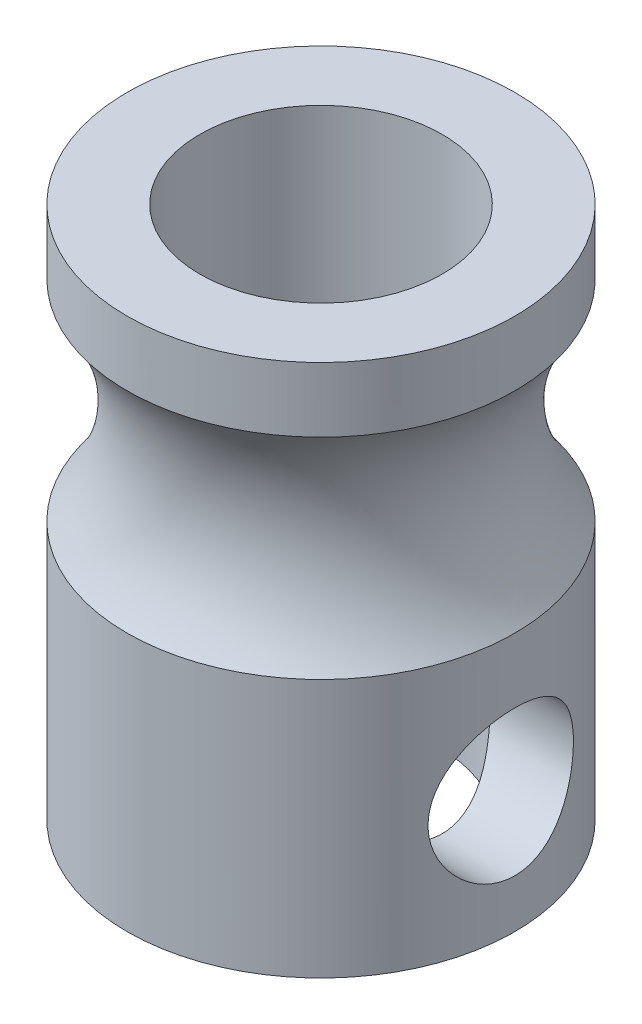
ISO-10303-21;
HEADER;
FILE_DESCRIPTION(('STEP AP214'),'2;1');
FILE_NAME('part.step','',(''),(''),'','','');
FILE_SCHEMA(('AUTOMOTIVE_DESIGN { 1 0 10303 214 1 1 1 1 }'));
ENDSEC;
DATA;
#1=APPLICATION_CONTEXT('core data for automotive mechanical design processes');
#2=APPLICATION_PROTOCOL_DEFINITION('international standard','automotive_design',2000,#1);
#3=PRODUCT_CONTEXT('',#1,'mechanical');
#4=PRODUCT('Part','Part','',(#3));
#5=PRODUCT_RELATED_PRODUCT_CATEGORY('part','',(#4));
#6=PRODUCT_DEFINITION_FORMATION('','',#4);
#7=PRODUCT_DEFINITION_CONTEXT('part definition',#1,'design');
#8=PRODUCT_DEFINITION('design','',#6,#7);
#9=PRODUCT_DEFINITION_SHAPE('','',#8);
#10=(LENGTH_UNIT() NAMED_UNIT(*) SI_UNIT(.MILLI.,.METRE.));
#11=(NAMED_UNIT(*) PLANE_ANGLE_UNIT() SI_UNIT($,.RADIAN.));
#12=(NAMED_UNIT(*) SI_UNIT($,.STERADIAN.) SOLID_ANGLE_UNIT());
#13=UNCERTAINTY_MEASURE_WITH_UNIT(LENGTH_MEASURE(1.E-05),#10,'distance_accuracy_value','');
#14=(GEOMETRIC_REPRESENTATION_CONTEXT(3) GLOBAL_UNCERTAINTY_ASSIGNED_CONTEXT((#13)) GLOBAL_UNIT_ASSIGNED_CONTEXT((#10,
#11,#12)) REPRESENTATION_CONTEXT('',''));
#15=CARTESIAN_POINT('',(0.,0.,0.));
#16=DIRECTION('',(0.,0.,1.));
#17=DIRECTION('',(1.,0.,0.));
#18=AXIS2_PLACEMENT_3D('',#15,#16,#17);
#19=CARTESIAN_POINT('',(0.,11.,0.));
#20=DIRECTION('',(0.,-1.,0.));
#21=DIRECTION('',(0.,0.,-1.));
#22=AXIS2_PLACEMENT_3D('',#19,#20,#21);
#23=CYLINDRICAL_SURFACE('',#22,4.);
#24=CARTESIAN_POINT('',(0.,5.3349364905389,0.));
#25=DIRECTION('',(0.,1.,0.));
#26=DIRECTION('',(0.,0.,1.));
#27=AXIS2_PLACEMENT_3D('',#24,#25,#26);
#28=CIRCLE('',#27,4.);
#29=CARTESIAN_POINT('',(0.,5.3349364905389,4.));
#30=VERTEX_POINT('',#29);
#31=EDGE_CURVE('E36',#30,#30,#28,.F.);
#32=ORIENTED_EDGE('',*,*,#31,.T.);
#33=EDGE_LOOP('',(#32));
#34=FACE_BOUND('',#33,.T.);
#35=CARTESIAN_POINT('',(0.,0.,0.));
#36=DIRECTION('',(0.,1.,0.));
#37=DIRECTION('',(0.,0.,1.));
#38=AXIS2_PLACEMENT_3D('',#35,#36,#37);
#39=CIRCLE('',#38,4.);
#40=CARTESIAN_POINT('',(0.,0.,4.));
#41=VERTEX_POINT('',#40);
#42=EDGE_CURVE('E45',#41,#41,#39,.T.);
#43=ORIENTED_EDGE('',*,*,#42,.T.);
#44=EDGE_LOOP('',(#43));
#45=FACE_BOUND('',#44,.T.);
#46=CARTESIAN_POINT('',(3.70809924354783,2.5,-1.5));
#47=CARTESIAN_POINT('',(3.70809640633806,2.41899251627921,-1.50000304106109));
#48=CARTESIAN_POINT('',(3.71078260240986,2.33800507749636,-1.49341597549487));
#49=CARTESIAN_POINT('',(3.72116159304967,2.1784719170868,-1.46736187895468));
#50=CARTESIAN_POINT('',(3.72885423767112,2.09992612240499,-1.44789523373263));
#51=CARTESIAN_POINT('',(3.748254802809,1.94762462838647,-1.39689657610574));
#52=CARTESIAN_POINT('',(3.7599530956926,1.87385794334892,-1.36539347266348));
#53=CARTESIAN_POINT('',(3.78603134206598,1.73262810318116,-1.29131856742698));
#54=CARTESIAN_POINT('',(3.80041210067323,1.66516684971748,-1.24874344095039));
#55=CARTESIAN_POINT('',(3.83103574665713,1.53510968837718,-1.15146661374162));
#56=CARTESIAN_POINT('',(3.84733341923603,1.47287147037061,-1.09630381213306));
#57=CARTESIAN_POINT('',(3.87949750628547,1.35827718532851,-0.976395839778926));
#58=CARTESIAN_POINT('',(3.89536382814785,1.30592322625815,-0.911648630256679));
#59=CARTESIAN_POINT('',(3.92552873936553,1.21086048770439,-0.771694655177599));
#60=CARTESIAN_POINT('',(3.93975561223505,1.16854052528414,-0.696206947538027));
#61=CARTESIAN_POINT('',(3.96438007973848,1.09734882747509,-0.538555771965247));
#62=CARTESIAN_POINT('',(3.97477900217006,1.06847242800803,-0.456394630933535));
#63=CARTESIAN_POINT('',(3.9901869710344,1.02624210422538,-0.291489341676831));
#64=CARTESIAN_POINT('',(3.99540915214774,1.01227237255954,-0.208923197281596));
#65=CARTESIAN_POINT('',(4.0006401410794,0.998278799055012,-0.0424643637947855));
#66=CARTESIAN_POINT('',(4.00065064414902,0.998250422381291,0.0414278850628334));
#67=CARTESIAN_POINT('',(3.99559265903894,1.01178176146517,0.203743543064476));
#68=CARTESIAN_POINT('',(3.99077541996683,1.02466929794882,0.2822321782669));
#69=CARTESIAN_POINT('',(3.97693274932263,1.06253591522555,0.435839217984391));
#70=CARTESIAN_POINT('',(3.96790701975577,1.08751585226204,0.510957383430298));
#71=CARTESIAN_POINT('',(3.94637769167531,1.14917045167585,0.656989017303104));
#72=CARTESIAN_POINT('',(3.93382539470077,1.18601000526841,0.72782539228731));
#73=CARTESIAN_POINT('',(3.90651310225279,1.27019209692939,0.86248660795756));
#74=CARTESIAN_POINT('',(3.8917523951284,1.3175380230176,0.926309176932323));
#75=CARTESIAN_POINT('',(3.86052529655816,1.42462728628319,1.04909048680094));
#76=CARTESIAN_POINT('',(3.84400963763883,1.48493391565043,1.10754614526348));
#77=CARTESIAN_POINT('',(3.81182460645722,1.61459299332156,1.21370395569342));
#78=CARTESIAN_POINT('',(3.79615544748847,1.68394770658664,1.261403406929));
#79=CARTESIAN_POINT('',(3.76712703500335,1.83171946746282,1.34565611808152));
#80=CARTESIAN_POINT('',(3.75382677150277,1.91030349368607,1.38193847851831));
#81=CARTESIAN_POINT('',(3.73172438629002,2.07309622516757,1.44056464441501));
#82=CARTESIAN_POINT('',(3.72291976205783,2.15730177159369,1.46291620605595));
#83=CARTESIAN_POINT('',(3.71139597222848,2.32397596231595,1.49190191709668));
#84=CARTESIAN_POINT('',(3.70836785241537,2.40628410553614,1.49933521158966));
#85=CARTESIAN_POINT('',(3.70786539525016,2.57100935674174,1.50057885636272));
#86=CARTESIAN_POINT('',(3.71038967003987,2.65342643235247,1.49439261093762));
#87=CARTESIAN_POINT('',(3.72039381629735,2.81192992228768,1.46929733520157));
#88=CARTESIAN_POINT('',(3.72763276216449,2.88813113576466,1.45100618334225));
#89=CARTESIAN_POINT('',(3.74596487046361,3.03634794472019,1.40299774640638));
#90=CARTESIAN_POINT('',(3.75705882250173,3.10836267916813,1.37327812034623));
#91=CARTESIAN_POINT('',(3.7823624311608,3.24916443807621,1.30200292275278));
#92=CARTESIAN_POINT('',(3.79667328892065,3.31772929213734,1.26004545177047));
#93=CARTESIAN_POINT('',(3.82662814294291,3.44712898172604,1.16591317862479));
#94=CARTESIAN_POINT('',(3.84227262594077,3.50796097462463,1.11373463696435));
#95=CARTESIAN_POINT('',(3.87433046553184,3.6241683731951,0.996727340900938));
#96=CARTESIAN_POINT('',(3.89072969357028,3.67895340876875,0.931306341491061));
#97=CARTESIAN_POINT('',(3.92149874963302,3.77683836758944,0.79179747175315));
#98=CARTESIAN_POINT('',(3.93586857107664,3.81993825294584,0.717709573322673));
#99=CARTESIAN_POINT('',(3.96094985704552,3.89294605619961,0.563016329468477));
#100=CARTESIAN_POINT('',(3.9716738133801,3.9228991237926,0.482434433064627));
#101=CARTESIAN_POINT('',(3.98829436712571,3.96865641384992,0.316881887523255));
#102=CARTESIAN_POINT('',(3.99419323299412,3.9844672854224,0.231913320723593));
#103=CARTESIAN_POINT('',(4.00028407317073,4.00077440275483,0.0653355852738156));
#104=CARTESIAN_POINT('',(4.00078860953764,4.00210948305899,-0.0161807680608453));
#105=CARTESIAN_POINT('',(3.99684889809223,3.99158484055461,-0.178226786412424));
#106=CARTESIAN_POINT('',(3.9924052471313,3.97972670911414,-0.258756569245257));
#107=CARTESIAN_POINT('',(3.97921089603771,3.94374114850638,-0.414548248377126));
#108=CARTESIAN_POINT('',(3.97056791378017,3.91992009412164,-0.489890731068834));
#109=CARTESIAN_POINT('',(3.9498778362099,3.86098998661564,-0.63551547300639));
#110=CARTESIAN_POINT('',(3.93783009655664,3.82587879669525,-0.705796771275542));
#111=CARTESIAN_POINT('',(3.91090618300074,3.74368605649519,-0.842540176994412));
#112=CARTESIAN_POINT('',(3.89593240108828,3.69616335948585,-0.908717548846849));
#113=CARTESIAN_POINT('',(3.86499507694844,3.59119216981239,-1.03241734752336));
#114=CARTESIAN_POINT('',(3.84903118274027,3.53374013419212,-1.0899366712559));
#115=CARTESIAN_POINT('',(3.81688129739175,3.40693586835494,-1.19781214236196));
#116=CARTESIAN_POINT('',(3.8007280534916,3.33711559784569,-1.24762999816025));
#117=CARTESIAN_POINT('',(3.77098325003638,3.18958413042667,-1.33484709556843));
#118=CARTESIAN_POINT('',(3.75739195631216,3.11187211594652,-1.37224504878157));
#119=CARTESIAN_POINT('',(3.73402269853266,2.94704431902459,-1.4346588697426));
#120=CARTESIAN_POINT('',(3.7244380329086,2.85966563348821,-1.45906002899523));
#121=CARTESIAN_POINT('',(3.71147994336315,2.68151472804421,-1.49172356722079));
#122=CARTESIAN_POINT('',(3.70810242179736,2.59074478729001,-1.4999965933957));
#123=CARTESIAN_POINT('',(3.70809924354783,2.5,-1.5));
#124=B_SPLINE_CURVE_WITH_KNOTS('',3,(#46,#47,#48,#49,#50,#51,#52,#53,#54,#55,#56,#57,#58,#59,
#60,#61,#62,#63,#64,#65,#66,#67,#68,#69,#70,#71,#72,#73,#74,#75,#76,#77,#78,#79,#80,#81,#82,#83,
#84,#85,#86,#87,#88,#89,#90,#91,#92,#93,#94,#95,#96,#97,#98,#99,#100,#101,#102,#103,#104,#105,
#106,#107,#108,#109,#110,#111,#112,#113,#114,#115,#116,#117,#118,#119,#120,#121,#122,#123),
.UNSPECIFIED.,.T.,.F.,(4,2,2,2,2,2,2,2,2,2,2,2,2,2,2,2,2,2,2,2,2,2,2,2,2,2,2,2,2,2,2,2,2,2,2,2,
2,2,4),(0.,0.24268454141617,0.485361814598854,0.72745985675703,0.969630679682933,
1.22274652401128,1.47591628822983,1.73770072136421,1.9993942638133,2.24980018489679,
2.50012465404857,2.73806472803194,2.97602165263335,3.21744131210668,3.45893893628976,
3.71456675065874,3.97025867827335,4.23162592252966,4.49284751635474,4.73965657740485,
4.98640395388884,5.22143845928198,5.45652113429526,5.70041561005821,5.94439948466355,
6.20385016993624,6.46330169650178,6.72185508890168,6.98028685560127,7.22365720549936,
7.4669982031948,7.7044027400389,7.94185223512831,8.18928323676987,8.43680270894964,
8.69738599542079,8.95799630544242,9.23003178870926,9.50188762323053),.UNSPECIFIED.);
#125=CARTESIAN_POINT('',(3.70809924354783,2.5,-1.5));
#126=VERTEX_POINT('',#125);
#127=EDGE_CURVE('E63',#126,#126,#124,.T.);
#128=ORIENTED_EDGE('',*,*,#127,.T.);
#129=EDGE_LOOP('',(#128));
#130=FACE_BOUND('',#129,.T.);
#131=ADVANCED_FACE('F31',(#34,#45,#130),#23,.T.);
#132=CARTESIAN_POINT('',(0.,11.,0.));
#133=DIRECTION('',(0.,1.,0.));
#134=DIRECTION('',(0.,0.,1.));
#135=AXIS2_PLACEMENT_3D('',#132,#133,#134);
#136=PLANE('',#135);
#137=CARTESIAN_POINT('',(0.,11.,0.));
#138=DIRECTION('',(0.,1.,0.));
#139=DIRECTION('',(0.,0.,1.));
#140=AXIS2_PLACEMENT_3D('',#137,#138,#139);
#141=CIRCLE('',#140,4.);
#142=CARTESIAN_POINT('',(0.,11.,4.));
#143=VERTEX_POINT('',#142);
#144=EDGE_CURVE('E40',#143,#143,#141,.T.);
#145=ORIENTED_EDGE('',*,*,#144,.T.);
#146=EDGE_LOOP('',(#145));
#147=FACE_BOUND('',#146,.T.);
#148=CARTESIAN_POINT('',(0.,11.,0.));
#149=DIRECTION('',(0.,1.,0.));
#150=DIRECTION('',(0.,0.,1.));
#151=AXIS2_PLACEMENT_3D('',#148,#149,#150);
#152=CIRCLE('',#151,2.5);
#153=CARTESIAN_POINT('',(0.,11.,2.5));
#154=VERTEX_POINT('',#153);
#155=EDGE_CURVE('E69',#154,#154,#152,.T.);
#156=ORIENTED_EDGE('',*,*,#155,.F.);
#157=EDGE_LOOP('',(#156));
#158=FACE_BOUND('',#157,.T.);
#159=ADVANCED_FACE('F85',(#147,#158),#136,.T.);
#160=CARTESIAN_POINT('',(0.,0.,0.));
#161=DIRECTION('',(0.,1.,0.));
#162=DIRECTION('',(0.,0.,1.));
#163=AXIS2_PLACEMENT_3D('',#160,#161,#162);
#164=PLANE('',#163);
#165=ORIENTED_EDGE('',*,*,#42,.F.);
#166=EDGE_LOOP('',(#165));
#167=FACE_BOUND('',#166,.T.);
#168=CARTESIAN_POINT('',(0.,0.,0.));
#169=DIRECTION('',(0.,1.,0.));
#170=DIRECTION('',(0.,0.,1.));
#171=AXIS2_PLACEMENT_3D('',#168,#169,#170);
#172=CIRCLE('',#171,2.5);
#173=CARTESIAN_POINT('',(0.,0.,2.5));
#174=VERTEX_POINT('',#173);
#175=EDGE_CURVE('E68',#174,#174,#172,.T.);
#176=ORIENTED_EDGE('',*,*,#175,.T.);
#177=EDGE_LOOP('',(#176));
#178=FACE_BOUND('',#177,.T.);
#179=ADVANCED_FACE('F75',(#167,#178),#164,.F.);
#180=CARTESIAN_POINT('',(0.,9.6650635094611,0.));
#181=DIRECTION('',(0.,-1.,0.));
#182=DIRECTION('',(0.,0.,-1.));
#183=AXIS2_PLACEMENT_3D('',#180,#181,#182);
#184=CIRCLE('',#183,4.);
#185=CARTESIAN_POINT('',(0.,9.6650635094611,-4.));
#186=VERTEX_POINT('',#185);
#187=EDGE_CURVE('E52',#186,#186,#184,.F.);
#188=ORIENTED_EDGE('',*,*,#187,.T.);
#189=EDGE_LOOP('',(#188));
#190=FACE_BOUND('',#189,.T.);
#191=ORIENTED_EDGE('',*,*,#144,.F.);
#192=EDGE_LOOP('',(#191));
#193=FACE_BOUND('',#192,.T.);
#194=ADVANCED_FACE('F33',(#190,#193),#23,.T.);
#195=CARTESIAN_POINT('',(0.,11.,0.));
#196=DIRECTION('',(0.,-1.,0.));
#197=DIRECTION('',(0.,0.,-1.));
#198=AXIS2_PLACEMENT_3D('',#195,#196,#197);
#199=CYLINDRICAL_SURFACE('',#198,2.5);
#200=CARTESIAN_POINT('',(2.,2.5,-1.5));
#201=CARTESIAN_POINT('',(1.99999416642511,2.42452102471036,-1.50000404108592));
#202=CARTESIAN_POINT('',(2.00433633903481,2.3490615659202,-1.49426852824013));
#203=CARTESIAN_POINT('',(2.02092590613883,2.20067609603778,-1.47174965152787));
#204=CARTESIAN_POINT('',(2.03318155043097,2.1277528126149,-1.45495475788936));
#205=CARTESIAN_POINT('',(2.0636233903473,1.98691635832272,-1.41143486335795));
#206=CARTESIAN_POINT('',(2.0817666618312,1.91897116196473,-1.3847815450315));
#207=CARTESIAN_POINT('',(2.12185904995836,1.78856254663208,-1.32252909283019));
#208=CARTESIAN_POINT('',(2.14380930122416,1.72610077030486,-1.28692729054693));
#209=CARTESIAN_POINT('',(2.19228594587542,1.60005098333592,-1.20271292747644));
#210=CARTESIAN_POINT('',(2.21904371037662,1.53725904287606,-1.15304179435289));
#211=CARTESIAN_POINT('',(2.27226229431061,1.42023523725825,-1.04426801309985));
#212=CARTESIAN_POINT('',(2.29872287517103,1.3660098483292,-0.985158296729612));
#213=CARTESIAN_POINT('',(2.35175567858734,1.2618661902903,-0.851442367411701));
#214=CARTESIAN_POINT('',(2.37803133577818,1.21304553633025,-0.775851995162547));
#215=CARTESIAN_POINT('',(2.42443786983179,1.12919027755557,-0.615654228271658));
#216=CARTESIAN_POINT('',(2.44457437988735,1.09414302587729,-0.53105519662633));
#217=CARTESIAN_POINT('',(2.4747098780044,1.04240407718735,-0.363771406742666));
#218=CARTESIAN_POINT('',(2.4854930393917,1.0242796390327,-0.281674698130914));
#219=CARTESIAN_POINT('',(2.49874939277545,1.00205719713688,-0.114970509382707));
#220=CARTESIAN_POINT('',(2.50123038813308,0.997946021999946,-0.0303654624001524));
#221=CARTESIAN_POINT('',(2.49783372711539,1.00361374734246,0.127637283737311));
#222=CARTESIAN_POINT('',(2.49295437513726,1.01173352616931,0.201123832865635));
#223=CARTESIAN_POINT('',(2.47707997553857,1.03847979564811,0.345464269151769));
#224=CARTESIAN_POINT('',(2.46608447529309,1.05710706390716,0.416317961051202));
#225=CARTESIAN_POINT('',(2.43884907201719,1.10416556270378,0.55405678046908));
#226=CARTESIAN_POINT('',(2.42257910450824,1.132653061139,0.620916491037618));
#227=CARTESIAN_POINT('',(2.38609637638748,1.19838461622554,0.748988660115612));
#228=CARTESIAN_POINT('',(2.36588259201812,1.23563094705901,0.810199646208012));
#229=CARTESIAN_POINT('',(2.32037925976362,1.32283909280445,0.9330742671432));
#230=CARTESIAN_POINT('',(2.2947718295215,1.37378831173574,0.993918663198194));
#231=CARTESIAN_POINT('',(2.24255554245601,1.48440411786018,1.10671465909275));
#232=CARTESIAN_POINT('',(2.21594536703375,1.54408250347451,1.1586540130834));
#233=CARTESIAN_POINT('',(2.16111075123946,1.67865340616355,1.25824837767417));
#234=CARTESIAN_POINT('',(2.13305661385124,1.75450757653946,1.30470933188632));
#235=CARTESIAN_POINT('',(2.08250879557267,1.91470623163661,1.38397217194232));
#236=CARTESIAN_POINT('',(2.0600049029882,1.99903471612564,1.41679921962189));
#237=CARTESIAN_POINT('',(2.02895865196731,2.15239363189535,1.46077497064843));
#238=CARTESIAN_POINT('',(2.01833888618316,2.22004063229664,1.47527903312665));
#239=CARTESIAN_POINT('',(2.00392150777558,2.35737361029948,1.49480872755284));
#240=CARTESIAN_POINT('',(2.00011596115116,2.42705712048456,1.49984538302907));
#241=CARTESIAN_POINT('',(1.99988914321323,2.56655168243571,1.50014781114183));
#242=CARTESIAN_POINT('',(2.00347810223984,2.63636277721521,1.49540004697659));
#243=CARTESIAN_POINT('',(2.01751520788652,2.77398734374856,1.47640290574941));
#244=CARTESIAN_POINT('',(2.02796877613213,2.84179919224025,1.46214601830139));
#245=CARTESIAN_POINT('',(2.054317683331,2.97371457947979,1.42488312618657));
#246=CARTESIAN_POINT('',(2.07020622092812,3.03782263653223,1.40188805257362));
#247=CARTESIAN_POINT('',(2.10571539417587,3.16147771573018,1.34796261057072));
#248=CARTESIAN_POINT('',(2.12533743689999,3.221023006366,1.31702924888212));
#249=CARTESIAN_POINT('',(2.17036819177737,3.34524008251225,1.24167439558512));
#250=CARTESIAN_POINT('',(2.19618239397369,3.40890083509657,1.19582663060303));
#251=CARTESIAN_POINT('',(2.2482175480362,3.52828548484946,1.09487395518701));
#252=CARTESIAN_POINT('',(2.27443886711455,3.58400169216912,1.03976018672402));
#253=CARTESIAN_POINT('',(2.32835625910913,3.69322400735043,0.913274837212766));
#254=CARTESIAN_POINT('',(2.3558007587587,3.74550072660584,0.840721108780191));
#255=CARTESIAN_POINT('',(2.40537639133459,3.83690277683665,0.68610310086802));
#256=CARTESIAN_POINT('',(2.42751104449411,3.87603682784092,0.604045176134702));
#257=CARTESIAN_POINT('',(2.46252280092775,3.93686820343137,0.438840232972138));
#258=CARTESIAN_POINT('',(2.47595588067329,3.95962622779111,0.356205963651258));
#259=CARTESIAN_POINT('',(2.494407389061,3.99071460284626,0.187383063890857));
#260=CARTESIAN_POINT('',(2.49943534582737,3.99906129071762,0.101198571781969));
#261=CARTESIAN_POINT('',(2.50040600461976,4.00067460858593,-0.0598120232009837));
#262=CARTESIAN_POINT('',(2.49747057186327,3.99580333456303,-0.134620583589706));
#263=CARTESIAN_POINT('',(2.48512948412095,3.97510617561839,-0.282148755978774));
#264=CARTESIAN_POINT('',(2.47572375706639,3.9592801686784,-0.354868344701914));
#265=CARTESIAN_POINT('',(2.45149427526962,3.91778042841621,-0.495145481978797));
#266=CARTESIAN_POINT('',(2.43675966858906,3.89226840387076,-0.56276703260883));
#267=CARTESIAN_POINT('',(2.40303337447155,3.83235940544525,-0.692781971999984));
#268=CARTESIAN_POINT('',(2.38404073252268,3.7979604391404,-0.755174184199832));
#269=CARTESIAN_POINT('',(2.34093432659381,3.71707480343124,-0.880263645295947));
#270=CARTESIAN_POINT('',(2.31648844639149,3.66968129098313,-0.94225869043994));
#271=CARTESIAN_POINT('',(2.26601907350661,3.56624696628228,-1.05789751536307));
#272=CARTESIAN_POINT('',(2.23999385274509,3.51019657439209,-1.11153190956916));
#273=CARTESIAN_POINT('',(2.18528165666204,3.3827144378223,-1.2159097535057));
#274=CARTESIAN_POINT('',(2.15667566270901,3.3102335138345,-1.26542406663367));
#275=CARTESIAN_POINT('',(2.10376464485145,3.15651514723346,-1.35156817210325));
#276=CARTESIAN_POINT('',(2.07945738811052,3.07528228601859,-1.38820466322661));
#277=CARTESIAN_POINT('',(2.0408000304796,2.9129357148628,-1.44437116535132));
#278=CARTESIAN_POINT('',(2.02577665830138,2.83240476403875,-1.46509526060187));
#279=CARTESIAN_POINT('',(2.00539032320036,2.66790260529632,-1.49289268240426));
#280=CARTESIAN_POINT('',(2.00000648744643,2.58393923424129,-1.49999550595837));
#281=CARTESIAN_POINT('',(2.,2.5,-1.5));
#282=B_SPLINE_CURVE_WITH_KNOTS('',3,(#200,#201,#202,#203,#204,#205,#206,#207,#208,#209,#210,
#211,#212,#213,#214,#215,#216,#217,#218,#219,#220,#221,#222,#223,#224,#225,#226,#227,#228,#229,
#230,#231,#232,#233,#234,#235,#236,#237,#238,#239,#240,#241,#242,#243,#244,#245,#246,#247,#248,
#249,#250,#251,#252,#253,#254,#255,#256,#257,#258,#259,#260,#261,#262,#263,#264,#265,#266,#267,
#268,#269,#270,#271,#272,#273,#274,#275,#276,#277,#278,#279,#280,#281),.UNSPECIFIED.,.T.,.F.,(4,
2,2,2,2,2,2,2,2,2,2,2,2,2,2,2,2,2,2,2,2,2,2,2,2,2,2,2,2,2,2,2,2,2,2,2,2,2,2,2,4),(0.,
0.226085249493392,0.45240657433077,0.677113624991876,0.901887762215932,1.15414462390001,
1.40659128601844,1.68630157736223,1.9657544327122,2.21853330858497,2.47107452602767,
2.69230130543182,2.91354445887944,3.13607155036377,3.35865648368878,3.60782810055849,
3.85733966656908,4.13576671140276,4.41367760154768,4.62276298054684,4.83160475643976,
5.04073566011181,5.25003193304128,5.45906724365495,5.66818149154661,5.91499438482002,
6.16204457978454,6.44121828011588,6.72020638384847,6.97891479383337,7.23732973022726,
7.46129321849399,7.68525920139648,7.90563970188756,8.12606965394584,8.37042963549487,
8.61506198741955,8.89071695766604,9.16622832484805,9.41820120134354,9.66962780912277),.UNSPECIFIED.);
#283=CARTESIAN_POINT('',(2.,2.5,-1.5));
#284=VERTEX_POINT('',#283);
#285=EDGE_CURVE('E10',#284,#284,#282,.T.);
#286=ORIENTED_EDGE('',*,*,#285,.F.);
#287=EDGE_LOOP('',(#286));
#288=FACE_BOUND('',#287,.T.);
#289=ORIENTED_EDGE('',*,*,#155,.T.);
#290=EDGE_LOOP('',(#289));
#291=FACE_BOUND('',#290,.T.);
#292=ORIENTED_EDGE('',*,*,#175,.F.);
#293=EDGE_LOOP('',(#292));
#294=FACE_BOUND('',#293,.T.);
#295=ADVANCED_FACE('F53',(#288,#291,#294),#199,.F.);
#296=CARTESIAN_POINT('',(2.,2.5,0.));
#297=DIRECTION('',(1.,0.,0.));
#298=DIRECTION('',(0.,0.,-1.));
#299=AXIS2_PLACEMENT_3D('',#296,#297,#298);
#300=CYLINDRICAL_SURFACE('',#299,1.5);
#301=ORIENTED_EDGE('',*,*,#285,.T.);
#302=EDGE_LOOP('',(#301));
#303=FACE_BOUND('',#302,.T.);
#304=ORIENTED_EDGE('',*,*,#127,.F.);
#305=EDGE_LOOP('',(#304));
#306=FACE_BOUND('',#305,.T.);
#307=ADVANCED_FACE('F56',(#303,#306),#300,.F.);
#308=CARTESIAN_POINT('',(0.,7.5,0.));
#309=DIRECTION('',(0.,-1.,0.));
#310=DIRECTION('',(0.,0.,-1.));
#311=AXIS2_PLACEMENT_3D('',#308,#309,#310);
#312=TOROIDAL_SURFACE('',#311,6.75,3.5);
#313=ORIENTED_EDGE('',*,*,#187,.F.);
#314=EDGE_LOOP('',(#313));
#315=FACE_BOUND('',#314,.T.);
#316=ORIENTED_EDGE('',*,*,#31,.F.);
#317=EDGE_LOOP('',(#316));
#318=FACE_BOUND('',#317,.T.);
#319=ADVANCED_FACE('F60',(#315,#318),#312,.F.);
#320=CLOSED_SHELL('',(#131,#159,#179,#194,#295,#307,#319));
#321=MANIFOLD_SOLID_BREP('B2',#320);
#322=ADVANCED_BREP_SHAPE_REPRESENTATION('',(#18,#321),#14);
#323=SHAPE_DEFINITION_REPRESENTATION(#9,#322);
ENDSEC;
END-ISO-10303-21;
